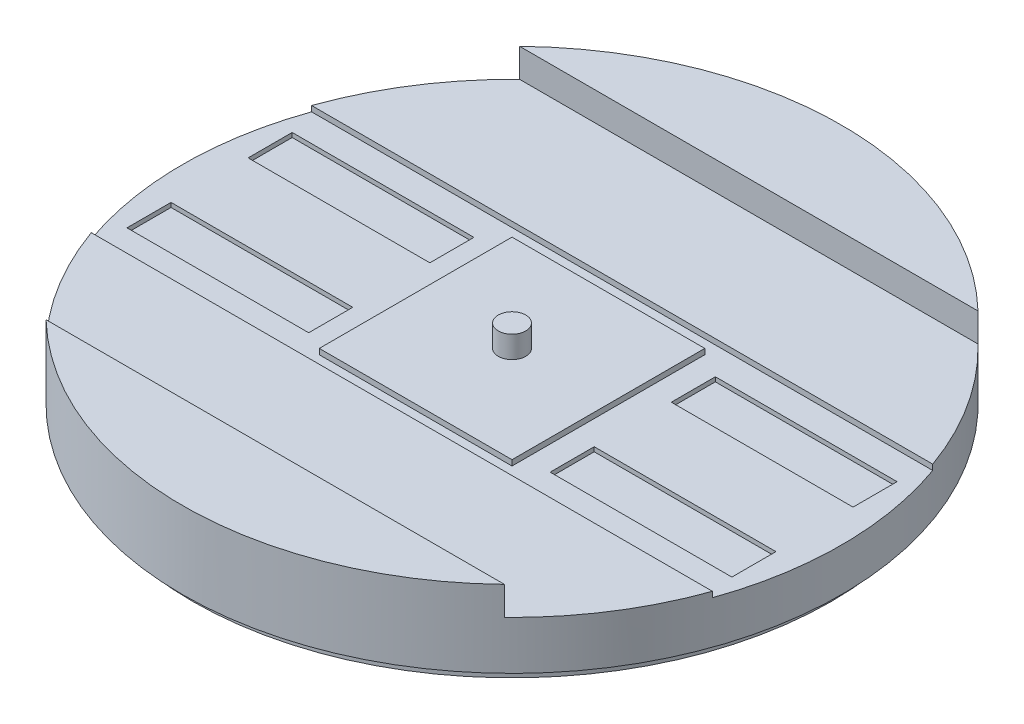
ISO-10303-21;
HEADER;
FILE_DESCRIPTION(('STEP AP214'),'2;1');
FILE_NAME('part.step','',(''),(''),'','','');
FILE_SCHEMA(('AUTOMOTIVE_DESIGN { 1 0 10303 214 1 1 1 1 }'));
ENDSEC;
DATA;
#1=APPLICATION_CONTEXT('core data for automotive mechanical design processes');
#2=APPLICATION_PROTOCOL_DEFINITION('international standard','automotive_design',2000,#1);
#3=PRODUCT_CONTEXT('',#1,'mechanical');
#4=PRODUCT('Part','Part','',(#3));
#5=PRODUCT_RELATED_PRODUCT_CATEGORY('part','',(#4));
#6=PRODUCT_DEFINITION_FORMATION('','',#4);
#7=PRODUCT_DEFINITION_CONTEXT('part definition',#1,'design');
#8=PRODUCT_DEFINITION('design','',#6,#7);
#9=PRODUCT_DEFINITION_SHAPE('','',#8);
#10=(LENGTH_UNIT() NAMED_UNIT(*) SI_UNIT(.MILLI.,.METRE.));
#11=(NAMED_UNIT(*) PLANE_ANGLE_UNIT() SI_UNIT($,.RADIAN.));
#12=(NAMED_UNIT(*) SI_UNIT($,.STERADIAN.) SOLID_ANGLE_UNIT());
#13=UNCERTAINTY_MEASURE_WITH_UNIT(LENGTH_MEASURE(1.E-05),#10,'distance_accuracy_value','');
#14=(GEOMETRIC_REPRESENTATION_CONTEXT(3) GLOBAL_UNCERTAINTY_ASSIGNED_CONTEXT((#13)) GLOBAL_UNIT_ASSIGNED_CONTEXT((#10,
#11,#12)) REPRESENTATION_CONTEXT('',''));
#15=CARTESIAN_POINT('',(0.,0.,0.));
#16=DIRECTION('',(0.,0.,1.));
#17=DIRECTION('',(1.,0.,0.));
#18=AXIS2_PLACEMENT_3D('',#15,#16,#17);
#19=CARTESIAN_POINT('',(-76.,9.906,0.));
#20=DIRECTION('',(0.,1.,0.));
#21=DIRECTION('',(0.,0.,1.));
#22=AXIS2_PLACEMENT_3D('',#19,#20,#21);
#23=PLANE('',#22);
#24=DIRECTION('',(0.,0.,-1.));
#25=VECTOR('',#24,1.);
#26=CARTESIAN_POINT('',(69.7538589904047,9.906,-19.05));
#27=LINE('',#26,#25);
#28=CARTESIAN_POINT('',(69.7538589904047,9.906,-8.88999999999998));
#29=VERTEX_POINT('',#28);
#30=CARTESIAN_POINT('',(69.7538589904047,9.906,-19.05));
#31=VERTEX_POINT('',#30);
#32=EDGE_CURVE('E71',#29,#31,#27,.T.);
#33=ORIENTED_EDGE('',*,*,#32,.F.);
#34=DIRECTION('',(1.,0.,0.));
#35=VECTOR('',#34,1.);
#36=CARTESIAN_POINT('',(69.7538589904047,9.906,-8.88999999999998));
#37=LINE('',#36,#35);
#38=CARTESIAN_POINT('',(27.8438589904047,9.906,-8.89000000000001));
#39=VERTEX_POINT('',#38);
#40=EDGE_CURVE('E368',#39,#29,#37,.T.);
#41=ORIENTED_EDGE('',*,*,#40,.F.);
#42=DIRECTION('',(0.,0.,1.));
#43=VECTOR('',#42,1.);
#44=CARTESIAN_POINT('',(27.8438589904047,9.906,-19.05));
#45=LINE('',#44,#43);
#46=CARTESIAN_POINT('',(27.8438589904047,9.906,-19.05));
#47=VERTEX_POINT('',#46);
#48=EDGE_CURVE('E372',#47,#39,#45,.T.);
#49=ORIENTED_EDGE('',*,*,#48,.F.);
#50=DIRECTION('',(-1.,0.,0.));
#51=VECTOR('',#50,1.);
#52=CARTESIAN_POINT('',(69.7538589904047,9.906,-19.05));
#53=LINE('',#52,#51);
#54=EDGE_CURVE('E377',#31,#47,#53,.T.);
#55=ORIENTED_EDGE('',*,*,#54,.F.);
#56=EDGE_LOOP('',(#33,#41,#49,#55));
#57=FACE_BOUND('',#56,.T.);
#58=DIRECTION('',(1.,0.,0.));
#59=VECTOR('',#58,1.);
#60=CARTESIAN_POINT('',(69.7538589904047,9.906,19.05));
#61=LINE('',#60,#59);
#62=CARTESIAN_POINT('',(27.8438589904047,9.906,19.05));
#63=VERTEX_POINT('',#62);
#64=CARTESIAN_POINT('',(69.7538589904047,9.906,19.05));
#65=VERTEX_POINT('',#64);
#66=EDGE_CURVE('E284',#63,#65,#61,.T.);
#67=ORIENTED_EDGE('',*,*,#66,.F.);
#68=DIRECTION('',(0.,0.,1.));
#69=VECTOR('',#68,1.);
#70=CARTESIAN_POINT('',(27.8438589904047,9.906,19.05));
#71=LINE('',#70,#69);
#72=CARTESIAN_POINT('',(27.8438589904047,9.906,8.89));
#73=VERTEX_POINT('',#72);
#74=EDGE_CURVE('E330',#73,#63,#71,.T.);
#75=ORIENTED_EDGE('',*,*,#74,.F.);
#76=DIRECTION('',(-1.,0.,0.));
#77=VECTOR('',#76,1.);
#78=CARTESIAN_POINT('',(69.7538589904047,9.906,8.89000000000001));
#79=LINE('',#78,#77);
#80=CARTESIAN_POINT('',(69.7538589904047,9.906,8.89000000000001));
#81=VERTEX_POINT('',#80);
#82=EDGE_CURVE('E334',#81,#73,#79,.T.);
#83=ORIENTED_EDGE('',*,*,#82,.F.);
#84=DIRECTION('',(0.,0.,-1.));
#85=VECTOR('',#84,1.);
#86=CARTESIAN_POINT('',(69.7538589904047,9.906,19.05));
#87=LINE('',#86,#85);
#88=EDGE_CURVE('E339',#65,#81,#87,.T.);
#89=ORIENTED_EDGE('',*,*,#88,.F.);
#90=EDGE_LOOP('',(#67,#75,#83,#89));
#91=FACE_BOUND('',#90,.T.);
#92=DIRECTION('',(0.,0.,1.));
#93=VECTOR('',#92,1.);
#94=CARTESIAN_POINT('',(-69.7538589904047,9.906,19.05));
#95=LINE('',#94,#93);
#96=CARTESIAN_POINT('',(-69.7538589904047,9.906,8.88999999999999));
#97=VERTEX_POINT('',#96);
#98=CARTESIAN_POINT('',(-69.7538589904047,9.906,19.05));
#99=VERTEX_POINT('',#98);
#100=EDGE_CURVE('E298',#97,#99,#95,.T.);
#101=ORIENTED_EDGE('',*,*,#100,.F.);
#102=DIRECTION('',(-1.,0.,0.));
#103=VECTOR('',#102,1.);
#104=CARTESIAN_POINT('',(-69.7538589904047,9.906,8.88999999999999));
#105=LINE('',#104,#103);
#106=CARTESIAN_POINT('',(-27.8438589904047,9.906,8.89));
#107=VERTEX_POINT('',#106);
#108=EDGE_CURVE('E285',#107,#97,#105,.T.);
#109=ORIENTED_EDGE('',*,*,#108,.F.);
#110=DIRECTION('',(0.,0.,-1.));
#111=VECTOR('',#110,1.);
#112=CARTESIAN_POINT('',(-27.8438589904047,9.906,19.05));
#113=LINE('',#112,#111);
#114=CARTESIAN_POINT('',(-27.8438589904047,9.906,19.05));
#115=VERTEX_POINT('',#114);
#116=EDGE_CURVE('E289',#115,#107,#113,.T.);
#117=ORIENTED_EDGE('',*,*,#116,.F.);
#118=DIRECTION('',(1.,0.,0.));
#119=VECTOR('',#118,1.);
#120=CARTESIAN_POINT('',(-69.7538589904047,9.906,19.05));
#121=LINE('',#120,#119);
#122=EDGE_CURVE('E294',#99,#115,#121,.T.);
#123=ORIENTED_EDGE('',*,*,#122,.F.);
#124=EDGE_LOOP('',(#101,#109,#117,#123));
#125=FACE_BOUND('',#124,.T.);
#126=DIRECTION('',(0.,0.,1.));
#127=VECTOR('',#126,1.);
#128=CARTESIAN_POINT('',(-69.7538589904047,9.906,-19.05));
#129=LINE('',#128,#127);
#130=CARTESIAN_POINT('',(-69.7538589904047,9.906,-19.05));
#131=VERTEX_POINT('',#130);
#132=CARTESIAN_POINT('',(-69.7538589904047,9.906,-8.89));
#133=VERTEX_POINT('',#132);
#134=EDGE_CURVE('E301',#131,#133,#129,.T.);
#135=ORIENTED_EDGE('',*,*,#134,.F.);
#136=DIRECTION('',(-1.,0.,0.));
#137=VECTOR('',#136,1.);
#138=CARTESIAN_POINT('',(-69.7538589904047,9.906,-19.05));
#139=LINE('',#138,#137);
#140=CARTESIAN_POINT('',(-27.8438589904047,9.906,-19.05));
#141=VERTEX_POINT('',#140);
#142=EDGE_CURVE('E402',#141,#131,#139,.T.);
#143=ORIENTED_EDGE('',*,*,#142,.F.);
#144=DIRECTION('',(0.,0.,-1.));
#145=VECTOR('',#144,1.);
#146=CARTESIAN_POINT('',(-27.8438589904047,9.906,-19.05));
#147=LINE('',#146,#145);
#148=CARTESIAN_POINT('',(-27.8438589904047,9.906,-8.89));
#149=VERTEX_POINT('',#148);
#150=EDGE_CURVE('E421',#149,#141,#147,.T.);
#151=ORIENTED_EDGE('',*,*,#150,.F.);
#152=DIRECTION('',(1.,0.,0.));
#153=VECTOR('',#152,1.);
#154=CARTESIAN_POINT('',(-69.7538589904047,9.906,-8.89));
#155=LINE('',#154,#153);
#156=EDGE_CURVE('E417',#133,#149,#155,.T.);
#157=ORIENTED_EDGE('',*,*,#156,.F.);
#158=EDGE_LOOP('',(#135,#143,#151,#157));
#159=FACE_BOUND('',#158,.T.);
#160=CARTESIAN_POINT('',(0.,9.906,0.));
#161=DIRECTION('',(0.,1.,0.));
#162=DIRECTION('',(0.,0.,1.));
#163=AXIS2_PLACEMENT_3D('',#160,#161,#162);
#164=CIRCLE('',#163,76.);
#165=CARTESIAN_POINT('',(71.6298820325707,9.906,25.4));
#166=VERTEX_POINT('',#165);
#167=CARTESIAN_POINT('',(71.6298820325707,9.906,-25.4));
#168=VERTEX_POINT('',#167);
#169=EDGE_CURVE('E55',#166,#168,#164,.T.);
#170=ORIENTED_EDGE('',*,*,#169,.T.);
#171=DIRECTION('',(-1.,0.,0.));
#172=VECTOR('',#171,1.);
#173=CARTESIAN_POINT('',(25.4,9.906,-25.4));
#174=LINE('',#173,#172);
#175=CARTESIAN_POINT('',(-71.6298820325707,9.906,-25.4));
#176=VERTEX_POINT('',#175);
#177=EDGE_CURVE('E444',#168,#176,#174,.T.);
#178=ORIENTED_EDGE('',*,*,#177,.T.);
#179=CARTESIAN_POINT('',(-71.6298820325707,9.906,25.4));
#180=VERTEX_POINT('',#179);
#181=EDGE_CURVE('E49',#176,#180,#164,.T.);
#182=ORIENTED_EDGE('',*,*,#181,.T.);
#183=DIRECTION('',(1.,0.,0.));
#184=VECTOR('',#183,1.);
#185=CARTESIAN_POINT('',(-76.,9.906,25.4));
#186=LINE('',#185,#184);
#187=EDGE_CURVE('E431',#180,#166,#186,.T.);
#188=ORIENTED_EDGE('',*,*,#187,.T.);
#189=EDGE_LOOP('',(#170,#178,#182,#188));
#190=FACE_BOUND('',#189,.T.);
#191=DIRECTION('',(-1.,0.,0.));
#192=VECTOR('',#191,1.);
#193=CARTESIAN_POINT('',(-22.225,9.906,-22.225));
#194=LINE('',#193,#192);
#195=CARTESIAN_POINT('',(22.225,9.906,-22.225));
#196=VERTEX_POINT('',#195);
#197=CARTESIAN_POINT('',(-22.225,9.906,-22.225));
#198=VERTEX_POINT('',#197);
#199=EDGE_CURVE('E959',#196,#198,#194,.T.);
#200=ORIENTED_EDGE('',*,*,#199,.F.);
#201=DIRECTION('',(0.,0.,-1.));
#202=VECTOR('',#201,1.);
#203=CARTESIAN_POINT('',(22.225,9.906,-22.225));
#204=LINE('',#203,#202);
#205=CARTESIAN_POINT('',(22.225,9.906,22.225));
#206=VERTEX_POINT('',#205);
#207=EDGE_CURVE('E258',#206,#196,#204,.T.);
#208=ORIENTED_EDGE('',*,*,#207,.F.);
#209=DIRECTION('',(1.,0.,0.));
#210=VECTOR('',#209,1.);
#211=CARTESIAN_POINT('',(-22.225,9.906,22.225));
#212=LINE('',#211,#210);
#213=CARTESIAN_POINT('',(-22.225,9.906,22.225));
#214=VERTEX_POINT('',#213);
#215=EDGE_CURVE('E254',#214,#206,#212,.T.);
#216=ORIENTED_EDGE('',*,*,#215,.F.);
#217=DIRECTION('',(0.,0.,1.));
#218=VECTOR('',#217,1.);
#219=CARTESIAN_POINT('',(-22.225,9.906,-22.225));
#220=LINE('',#219,#218);
#221=EDGE_CURVE('E962',#198,#214,#220,.T.);
#222=ORIENTED_EDGE('',*,*,#221,.F.);
#223=EDGE_LOOP('',(#200,#208,#216,#222));
#224=FACE_BOUND('',#223,.T.);
#225=ADVANCED_FACE('F45',(#57,#91,#125,#159,#190,#224),#23,.T.);
#226=CARTESIAN_POINT('',(-76.,11.176,0.));
#227=DIRECTION('',(0.,1.,0.));
#228=DIRECTION('',(0.,0.,1.));
#229=AXIS2_PLACEMENT_3D('',#226,#227,#228);
#230=PLANE('',#229);
#231=DIRECTION('',(-1.,0.,0.));
#232=VECTOR('',#231,1.);
#233=CARTESIAN_POINT('',(-76.,11.176,-25.4));
#234=LINE('',#233,#232);
#235=CARTESIAN_POINT('',(71.6298820325707,11.176,-25.4));
#236=VERTEX_POINT('',#235);
#237=CARTESIAN_POINT('',(-71.6298820325707,11.176,-25.4));
#238=VERTEX_POINT('',#237);
#239=EDGE_CURVE('E512',#236,#238,#234,.T.);
#240=ORIENTED_EDGE('',*,*,#239,.F.);
#241=CARTESIAN_POINT('',(0.,11.176,0.));
#242=DIRECTION('',(0.,1.,0.));
#243=DIRECTION('',(0.,0.,1.));
#244=AXIS2_PLACEMENT_3D('',#241,#242,#243);
#245=CIRCLE('',#244,76.);
#246=CARTESIAN_POINT('',(52.8559164143428,11.176,-54.61));
#247=VERTEX_POINT('',#246);
#248=EDGE_CURVE('E508',#236,#247,#245,.T.);
#249=ORIENTED_EDGE('',*,*,#248,.T.);
#250=DIRECTION('',(-1.,0.,0.));
#251=VECTOR('',#250,1.);
#252=CARTESIAN_POINT('',(-76.,11.176,-54.61));
#253=LINE('',#252,#251);
#254=CARTESIAN_POINT('',(-52.8559164143429,11.176,-54.61));
#255=VERTEX_POINT('',#254);
#256=EDGE_CURVE('E468',#247,#255,#253,.T.);
#257=ORIENTED_EDGE('',*,*,#256,.T.);
#258=EDGE_CURVE('E504',#255,#238,#245,.T.);
#259=ORIENTED_EDGE('',*,*,#258,.T.);
#260=EDGE_LOOP('',(#240,#249,#257,#259));
#261=FACE_BOUND('',#260,.T.);
#262=ADVANCED_FACE('F559',(#261),#230,.T.);
#263=CARTESIAN_POINT('',(0.,17.78,0.));
#264=DIRECTION('',(0.,1.,0.));
#265=DIRECTION('',(0.,0.,1.));
#266=AXIS2_PLACEMENT_3D('',#263,#264,#265);
#267=PLANE('',#266);
#268=DIRECTION('',(-1.,0.,0.));
#269=VECTOR('',#268,1.);
#270=CARTESIAN_POINT('',(0.,17.78,-54.61));
#271=LINE('',#270,#269);
#272=CARTESIAN_POINT('',(52.8559164143429,17.78,-54.61));
#273=VERTEX_POINT('',#272);
#274=CARTESIAN_POINT('',(-52.8559164143429,17.78,-54.61));
#275=VERTEX_POINT('',#274);
#276=EDGE_CURVE('E500',#273,#275,#271,.T.);
#277=ORIENTED_EDGE('',*,*,#276,.F.);
#278=CARTESIAN_POINT('',(0.,17.78,0.));
#279=DIRECTION('',(0.,1.,0.));
#280=DIRECTION('',(0.,0.,1.));
#281=AXIS2_PLACEMENT_3D('',#278,#279,#280);
#282=CIRCLE('',#281,76.);
#283=EDGE_CURVE('E493',#273,#275,#282,.T.);
#284=ORIENTED_EDGE('',*,*,#283,.T.);
#285=EDGE_LOOP('',(#277,#284));
#286=FACE_BOUND('',#285,.T.);
#287=ADVANCED_FACE('F550',(#286),#267,.T.);
#288=CARTESIAN_POINT('',(0.,17.78,0.));
#289=DIRECTION('',(0.,-1.,0.));
#290=DIRECTION('',(0.,0.,-1.));
#291=AXIS2_PLACEMENT_3D('',#288,#289,#290);
#292=CYLINDRICAL_SURFACE('',#291,76.);
#293=ORIENTED_EDGE('',*,*,#248,.F.);
#294=DIRECTION('',(0.,-1.,0.));
#295=VECTOR('',#294,1.);
#296=CARTESIAN_POINT('',(71.6298820325707,17.78,-25.4));
#297=LINE('',#296,#295);
#298=EDGE_CURVE('E460',#236,#168,#297,.T.);
#299=ORIENTED_EDGE('',*,*,#298,.T.);
#300=ORIENTED_EDGE('',*,*,#169,.F.);
#301=DIRECTION('',(0.,-1.,0.));
#302=VECTOR('',#301,1.);
#303=CARTESIAN_POINT('',(71.6298820325707,17.78,25.4));
#304=LINE('',#303,#302);
#305=CARTESIAN_POINT('',(71.6298820325707,11.176,25.4));
#306=VERTEX_POINT('',#305);
#307=EDGE_CURVE('E448',#166,#306,#304,.F.);
#308=ORIENTED_EDGE('',*,*,#307,.T.);
#309=CARTESIAN_POINT('',(52.8559164143429,11.176,54.61));
#310=VERTEX_POINT('',#309);
#311=EDGE_CURVE('E509',#310,#306,#245,.T.);
#312=ORIENTED_EDGE('',*,*,#311,.F.);
#313=DIRECTION('',(0.,-1.,0.));
#314=VECTOR('',#313,1.);
#315=CARTESIAN_POINT('',(52.8559164143429,17.78,54.61));
#316=LINE('',#315,#314);
#317=CARTESIAN_POINT('',(52.8559164143429,17.78,54.61));
#318=VERTEX_POINT('',#317);
#319=EDGE_CURVE('E472',#310,#318,#316,.F.);
#320=ORIENTED_EDGE('',*,*,#319,.T.);
#321=CARTESIAN_POINT('',(-52.8559164143429,17.78,54.61));
#322=VERTEX_POINT('',#321);
#323=EDGE_CURVE('E489',#322,#318,#282,.T.);
#324=ORIENTED_EDGE('',*,*,#323,.F.);
#325=DIRECTION('',(0.,-1.,0.));
#326=VECTOR('',#325,1.);
#327=CARTESIAN_POINT('',(-52.8559164143429,17.78,54.61));
#328=LINE('',#327,#326);
#329=CARTESIAN_POINT('',(-52.8559164143429,11.176,54.61));
#330=VERTEX_POINT('',#329);
#331=EDGE_CURVE('E476',#322,#330,#328,.T.);
#332=ORIENTED_EDGE('',*,*,#331,.T.);
#333=CARTESIAN_POINT('',(-71.6298820325707,11.176,25.4));
#334=VERTEX_POINT('',#333);
#335=EDGE_CURVE('E503',#334,#330,#245,.T.);
#336=ORIENTED_EDGE('',*,*,#335,.F.);
#337=DIRECTION('',(0.,-1.,0.));
#338=VECTOR('',#337,1.);
#339=CARTESIAN_POINT('',(-71.6298820325707,17.78,25.4));
#340=LINE('',#339,#338);
#341=EDGE_CURVE('E452',#334,#180,#340,.T.);
#342=ORIENTED_EDGE('',*,*,#341,.T.);
#343=ORIENTED_EDGE('',*,*,#181,.F.);
#344=DIRECTION('',(0.,-1.,0.));
#345=VECTOR('',#344,1.);
#346=CARTESIAN_POINT('',(-71.6298820325707,17.78,-25.4));
#347=LINE('',#346,#345);
#348=EDGE_CURVE('E456',#176,#238,#347,.F.);
#349=ORIENTED_EDGE('',*,*,#348,.T.);
#350=ORIENTED_EDGE('',*,*,#258,.F.);
#351=DIRECTION('',(0.,-1.,0.));
#352=VECTOR('',#351,1.);
#353=CARTESIAN_POINT('',(-52.8559164143429,17.78,-54.61));
#354=LINE('',#353,#352);
#355=EDGE_CURVE('E480',#255,#275,#354,.F.);
#356=ORIENTED_EDGE('',*,*,#355,.T.);
#357=ORIENTED_EDGE('',*,*,#283,.F.);
#358=DIRECTION('',(0.,-1.,0.));
#359=VECTOR('',#358,1.);
#360=CARTESIAN_POINT('',(52.8559164143429,17.78,-54.61));
#361=LINE('',#360,#359);
#362=EDGE_CURVE('E484',#273,#247,#361,.T.);
#363=ORIENTED_EDGE('',*,*,#362,.T.);
#364=EDGE_LOOP('',(#293,#299,#300,#308,#312,#320,#324,#332,#336,#342,#343,#349,#350,#356,#357,#363));
#365=FACE_BOUND('',#364,.T.);
#366=CARTESIAN_POINT('',(0.,0.,0.));
#367=DIRECTION('',(0.,1.,0.));
#368=DIRECTION('',(0.,0.,1.));
#369=AXIS2_PLACEMENT_3D('',#366,#367,#368);
#370=CIRCLE('',#369,76.);
#371=CARTESIAN_POINT('',(0.,0.,76.));
#372=VERTEX_POINT('',#371);
#373=EDGE_CURVE('E488',#372,#372,#370,.T.);
#374=ORIENTED_EDGE('',*,*,#373,.T.);
#375=EDGE_LOOP('',(#374));
#376=FACE_BOUND('',#375,.T.);
#377=ADVANCED_FACE('F47',(#365,#376),#292,.T.);
#378=DIRECTION('',(1.,0.,0.));
#379=VECTOR('',#378,1.);
#380=CARTESIAN_POINT('',(0.,17.78,54.61));
#381=LINE('',#380,#379);
#382=EDGE_CURVE('E497',#322,#318,#381,.T.);
#383=ORIENTED_EDGE('',*,*,#382,.F.);
#384=ORIENTED_EDGE('',*,*,#323,.T.);
#385=EDGE_LOOP('',(#383,#384));
#386=FACE_BOUND('',#385,.T.);
#387=ADVANCED_FACE('F546',(#386),#267,.T.);
#388=CARTESIAN_POINT('',(0.,0.,0.));
#389=DIRECTION('',(0.,1.,0.));
#390=DIRECTION('',(0.,0.,1.));
#391=AXIS2_PLACEMENT_3D('',#388,#389,#390);
#392=PLANE('',#391);
#393=CARTESIAN_POINT('',(0.,0.,0.));
#394=DIRECTION('',(0.,-1.,0.));
#395=DIRECTION('',(0.,0.,-1.));
#396=AXIS2_PLACEMENT_3D('',#393,#394,#395);
#397=CIRCLE('',#396,73.66);
#398=CARTESIAN_POINT('',(0.,0.,-73.66));
#399=VERTEX_POINT('',#398);
#400=EDGE_CURVE('E11',#399,#399,#397,.T.);
#401=ORIENTED_EDGE('',*,*,#400,.F.);
#402=EDGE_LOOP('',(#401));
#403=FACE_BOUND('',#402,.T.);
#404=ORIENTED_EDGE('',*,*,#373,.F.);
#405=EDGE_LOOP('',(#404));
#406=FACE_BOUND('',#405,.T.);
#407=ADVANCED_FACE('F548',(#403,#406),#392,.F.);
#408=DIRECTION('',(1.,0.,0.));
#409=VECTOR('',#408,1.);
#410=CARTESIAN_POINT('',(-76.,11.176,25.4));
#411=LINE('',#410,#409);
#412=EDGE_CURVE('E510',#334,#306,#411,.T.);
#413=ORIENTED_EDGE('',*,*,#412,.F.);
#414=ORIENTED_EDGE('',*,*,#335,.T.);
#415=DIRECTION('',(1.,0.,0.));
#416=VECTOR('',#415,1.);
#417=CARTESIAN_POINT('',(-76.,11.176,54.61));
#418=LINE('',#417,#416);
#419=EDGE_CURVE('E464',#330,#310,#418,.T.);
#420=ORIENTED_EDGE('',*,*,#419,.T.);
#421=ORIENTED_EDGE('',*,*,#311,.T.);
#422=EDGE_LOOP('',(#413,#414,#420,#421));
#423=FACE_BOUND('',#422,.T.);
#424=ADVANCED_FACE('F539',(#423),#230,.T.);
#425=CARTESIAN_POINT('',(-76.,11.176,-54.61));
#426=DIRECTION('',(0.,0.,-1.));
#427=DIRECTION('',(-1.,0.,0.));
#428=AXIS2_PLACEMENT_3D('',#425,#426,#427);
#429=PLANE('',#428);
#430=ORIENTED_EDGE('',*,*,#276,.T.);
#431=ORIENTED_EDGE('',*,*,#355,.F.);
#432=ORIENTED_EDGE('',*,*,#256,.F.);
#433=ORIENTED_EDGE('',*,*,#362,.F.);
#434=EDGE_LOOP('',(#430,#431,#432,#433));
#435=FACE_BOUND('',#434,.T.);
#436=ADVANCED_FACE('F582',(#435),#429,.F.);
#437=CARTESIAN_POINT('',(-76.,11.176,54.61));
#438=DIRECTION('',(0.,0.,1.));
#439=DIRECTION('',(1.,0.,0.));
#440=AXIS2_PLACEMENT_3D('',#437,#438,#439);
#441=PLANE('',#440);
#442=ORIENTED_EDGE('',*,*,#382,.T.);
#443=ORIENTED_EDGE('',*,*,#319,.F.);
#444=ORIENTED_EDGE('',*,*,#419,.F.);
#445=ORIENTED_EDGE('',*,*,#331,.F.);
#446=EDGE_LOOP('',(#442,#443,#444,#445));
#447=FACE_BOUND('',#446,.T.);
#448=ADVANCED_FACE('F542',(#447),#441,.F.);
#449=CARTESIAN_POINT('',(-76.,9.906,-25.4));
#450=DIRECTION('',(0.,0.,-1.));
#451=DIRECTION('',(-1.,0.,0.));
#452=AXIS2_PLACEMENT_3D('',#449,#450,#451);
#453=PLANE('',#452);
#454=ORIENTED_EDGE('',*,*,#239,.T.);
#455=ORIENTED_EDGE('',*,*,#348,.F.);
#456=ORIENTED_EDGE('',*,*,#177,.F.);
#457=ORIENTED_EDGE('',*,*,#298,.F.);
#458=EDGE_LOOP('',(#454,#455,#456,#457));
#459=FACE_BOUND('',#458,.T.);
#460=ADVANCED_FACE('F525',(#459),#453,.F.);
#461=CARTESIAN_POINT('',(25.4,9.906,25.4));
#462=DIRECTION('',(0.,0.,1.));
#463=DIRECTION('',(1.,0.,0.));
#464=AXIS2_PLACEMENT_3D('',#461,#462,#463);
#465=PLANE('',#464);
#466=ORIENTED_EDGE('',*,*,#412,.T.);
#467=ORIENTED_EDGE('',*,*,#307,.F.);
#468=ORIENTED_EDGE('',*,*,#187,.F.);
#469=ORIENTED_EDGE('',*,*,#341,.F.);
#470=EDGE_LOOP('',(#466,#467,#468,#469));
#471=FACE_BOUND('',#470,.T.);
#472=ADVANCED_FACE('F577',(#471),#465,.F.);
#473=CARTESIAN_POINT('',(-69.7538589904047,8.89,-19.05));
#474=DIRECTION('',(-1.,0.,0.));
#475=DIRECTION('',(0.,0.,1.));
#476=AXIS2_PLACEMENT_3D('',#473,#474,#475);
#477=PLANE('',#476);
#478=ORIENTED_EDGE('',*,*,#134,.T.);
#479=DIRECTION('',(0.,1.,0.));
#480=VECTOR('',#479,1.);
#481=CARTESIAN_POINT('',(-69.7538589904047,8.89,-8.89));
#482=LINE('',#481,#480);
#483=CARTESIAN_POINT('',(-69.7538589904047,8.89,-8.89));
#484=VERTEX_POINT('',#483);
#485=EDGE_CURVE('E414',#484,#133,#482,.T.);
#486=ORIENTED_EDGE('',*,*,#485,.F.);
#487=DIRECTION('',(0.,0.,1.));
#488=VECTOR('',#487,1.);
#489=CARTESIAN_POINT('',(-69.7538589904047,8.89,-19.05));
#490=LINE('',#489,#488);
#491=CARTESIAN_POINT('',(-69.7538589904047,8.89,-19.05));
#492=VERTEX_POINT('',#491);
#493=EDGE_CURVE('E397',#492,#484,#490,.T.);
#494=ORIENTED_EDGE('',*,*,#493,.F.);
#495=DIRECTION('',(0.,1.,0.));
#496=VECTOR('',#495,1.);
#497=CARTESIAN_POINT('',(-69.7538589904047,8.89,-19.05));
#498=LINE('',#497,#496);
#499=EDGE_CURVE('E428',#492,#131,#498,.T.);
#500=ORIENTED_EDGE('',*,*,#499,.T.);
#501=EDGE_LOOP('',(#478,#486,#494,#500));
#502=FACE_BOUND('',#501,.T.);
#503=ADVANCED_FACE('F573',(#502),#477,.F.);
#504=CARTESIAN_POINT('',(-69.7538589904047,8.89,-19.05));
#505=DIRECTION('',(0.,0.,-1.));
#506=DIRECTION('',(-1.,0.,0.));
#507=AXIS2_PLACEMENT_3D('',#504,#505,#506);
#508=PLANE('',#507);
#509=ORIENTED_EDGE('',*,*,#142,.T.);
#510=ORIENTED_EDGE('',*,*,#499,.F.);
#511=DIRECTION('',(-1.,0.,0.));
#512=VECTOR('',#511,1.);
#513=CARTESIAN_POINT('',(-69.7538589904047,8.89,-19.05));
#514=LINE('',#513,#512);
#515=CARTESIAN_POINT('',(-27.8438589904047,8.89,-19.05));
#516=VERTEX_POINT('',#515);
#517=EDGE_CURVE('E410',#516,#492,#514,.T.);
#518=ORIENTED_EDGE('',*,*,#517,.F.);
#519=DIRECTION('',(0.,1.,0.));
#520=VECTOR('',#519,1.);
#521=CARTESIAN_POINT('',(-27.8438589904047,8.89,-19.05));
#522=LINE('',#521,#520);
#523=EDGE_CURVE('E432',#516,#141,#522,.T.);
#524=ORIENTED_EDGE('',*,*,#523,.T.);
#525=EDGE_LOOP('',(#509,#510,#518,#524));
#526=FACE_BOUND('',#525,.T.);
#527=ADVANCED_FACE('F623',(#526),#508,.F.);
#528=CARTESIAN_POINT('',(-27.8438589904047,8.89,-19.05));
#529=DIRECTION('',(1.,0.,0.));
#530=DIRECTION('',(0.,0.,-1.));
#531=AXIS2_PLACEMENT_3D('',#528,#529,#530);
#532=PLANE('',#531);
#533=ORIENTED_EDGE('',*,*,#150,.T.);
#534=ORIENTED_EDGE('',*,*,#523,.F.);
#535=DIRECTION('',(0.,0.,-1.));
#536=VECTOR('',#535,1.);
#537=CARTESIAN_POINT('',(-27.8438589904047,8.89,-19.05));
#538=LINE('',#537,#536);
#539=CARTESIAN_POINT('',(-27.8438589904047,8.89,-8.89));
#540=VERTEX_POINT('',#539);
#541=EDGE_CURVE('E406',#540,#516,#538,.T.);
#542=ORIENTED_EDGE('',*,*,#541,.F.);
#543=DIRECTION('',(0.,1.,0.));
#544=VECTOR('',#543,1.);
#545=CARTESIAN_POINT('',(-27.8438589904047,8.89,-8.89));
#546=LINE('',#545,#544);
#547=EDGE_CURVE('E435',#540,#149,#546,.T.);
#548=ORIENTED_EDGE('',*,*,#547,.T.);
#549=EDGE_LOOP('',(#533,#534,#542,#548));
#550=FACE_BOUND('',#549,.T.);
#551=ADVANCED_FACE('F631',(#550),#532,.F.);
#552=CARTESIAN_POINT('',(-69.7538589904047,8.89,-8.89));
#553=DIRECTION('',(0.,0.,1.));
#554=DIRECTION('',(1.,0.,0.));
#555=AXIS2_PLACEMENT_3D('',#552,#553,#554);
#556=PLANE('',#555);
#557=ORIENTED_EDGE('',*,*,#156,.T.);
#558=ORIENTED_EDGE('',*,*,#547,.F.);
#559=DIRECTION('',(1.,0.,0.));
#560=VECTOR('',#559,1.);
#561=CARTESIAN_POINT('',(-69.7538589904047,8.89,-8.89));
#562=LINE('',#561,#560);
#563=EDGE_CURVE('E401',#484,#540,#562,.T.);
#564=ORIENTED_EDGE('',*,*,#563,.F.);
#565=ORIENTED_EDGE('',*,*,#485,.T.);
#566=EDGE_LOOP('',(#557,#558,#564,#565));
#567=FACE_BOUND('',#566,.T.);
#568=ADVANCED_FACE('F640',(#567),#556,.F.);
#569=CARTESIAN_POINT('',(0.,8.89,0.));
#570=DIRECTION('',(0.,1.,0.));
#571=DIRECTION('',(0.,0.,1.));
#572=AXIS2_PLACEMENT_3D('',#569,#570,#571);
#573=PLANE('',#572);
#574=ORIENTED_EDGE('',*,*,#493,.T.);
#575=ORIENTED_EDGE('',*,*,#563,.T.);
#576=ORIENTED_EDGE('',*,*,#541,.T.);
#577=ORIENTED_EDGE('',*,*,#517,.T.);
#578=EDGE_LOOP('',(#574,#575,#576,#577));
#579=FACE_BOUND('',#578,.T.);
#580=ADVANCED_FACE('F649',(#579),#573,.T.);
#581=CARTESIAN_POINT('',(-69.7538589904047,8.89,19.05));
#582=DIRECTION('',(-1.,0.,0.));
#583=DIRECTION('',(0.,0.,1.));
#584=AXIS2_PLACEMENT_3D('',#581,#582,#583);
#585=PLANE('',#584);
#586=ORIENTED_EDGE('',*,*,#100,.T.);
#587=DIRECTION('',(0.,1.,0.));
#588=VECTOR('',#587,1.);
#589=CARTESIAN_POINT('',(-69.7538589904047,8.89,19.05));
#590=LINE('',#589,#588);
#591=CARTESIAN_POINT('',(-69.7538589904047,8.89,19.05));
#592=VERTEX_POINT('',#591);
#593=EDGE_CURVE('E270',#592,#99,#590,.T.);
#594=ORIENTED_EDGE('',*,*,#593,.F.);
#595=DIRECTION('',(0.,0.,1.));
#596=VECTOR('',#595,1.);
#597=CARTESIAN_POINT('',(-69.7538589904047,8.89,19.05));
#598=LINE('',#597,#596);
#599=CARTESIAN_POINT('',(-69.7538589904047,8.89,8.88999999999999));
#600=VERTEX_POINT('',#599);
#601=EDGE_CURVE('E290',#600,#592,#598,.T.);
#602=ORIENTED_EDGE('',*,*,#601,.F.);
#603=DIRECTION('',(0.,1.,0.));
#604=VECTOR('',#603,1.);
#605=CARTESIAN_POINT('',(-69.7538589904047,8.89,8.88999999999999));
#606=LINE('',#605,#604);
#607=EDGE_CURVE('E281',#600,#97,#606,.T.);
#608=ORIENTED_EDGE('',*,*,#607,.T.);
#609=EDGE_LOOP('',(#586,#594,#602,#608));
#610=FACE_BOUND('',#609,.T.);
#611=ADVANCED_FACE('F657',(#610),#585,.F.);
#612=CARTESIAN_POINT('',(-69.7538589904047,8.89,8.88999999999999));
#613=DIRECTION('',(0.,0.,-1.));
#614=DIRECTION('',(-1.,0.,0.));
#615=AXIS2_PLACEMENT_3D('',#612,#613,#614);
#616=PLANE('',#615);
#617=ORIENTED_EDGE('',*,*,#108,.T.);
#618=ORIENTED_EDGE('',*,*,#607,.F.);
#619=DIRECTION('',(-1.,0.,0.));
#620=VECTOR('',#619,1.);
#621=CARTESIAN_POINT('',(-69.7538589904047,8.89,8.88999999999999));
#622=LINE('',#621,#620);
#623=CARTESIAN_POINT('',(-27.8438589904047,8.89,8.89));
#624=VERTEX_POINT('',#623);
#625=EDGE_CURVE('E274',#624,#600,#622,.T.);
#626=ORIENTED_EDGE('',*,*,#625,.F.);
#627=DIRECTION('',(0.,1.,0.));
#628=VECTOR('',#627,1.);
#629=CARTESIAN_POINT('',(-27.8438589904047,8.89,8.89));
#630=LINE('',#629,#628);
#631=EDGE_CURVE('E278',#624,#107,#630,.T.);
#632=ORIENTED_EDGE('',*,*,#631,.T.);
#633=EDGE_LOOP('',(#617,#618,#626,#632));
#634=FACE_BOUND('',#633,.T.);
#635=ADVANCED_FACE('F666',(#634),#616,.F.);
#636=CARTESIAN_POINT('',(-27.8438589904047,8.89,19.05));
#637=DIRECTION('',(1.,0.,0.));
#638=DIRECTION('',(0.,0.,-1.));
#639=AXIS2_PLACEMENT_3D('',#636,#637,#638);
#640=PLANE('',#639);
#641=ORIENTED_EDGE('',*,*,#116,.T.);
#642=ORIENTED_EDGE('',*,*,#631,.F.);
#643=DIRECTION('',(0.,0.,-1.));
#644=VECTOR('',#643,1.);
#645=CARTESIAN_POINT('',(-27.8438589904047,8.89,19.05));
#646=LINE('',#645,#644);
#647=CARTESIAN_POINT('',(-27.8438589904047,8.89,19.05));
#648=VERTEX_POINT('',#647);
#649=EDGE_CURVE('E305',#648,#624,#646,.T.);
#650=ORIENTED_EDGE('',*,*,#649,.F.);
#651=DIRECTION('',(0.,1.,0.));
#652=VECTOR('',#651,1.);
#653=CARTESIAN_POINT('',(-27.8438589904047,8.89,19.05));
#654=LINE('',#653,#652);
#655=EDGE_CURVE('E275',#648,#115,#654,.T.);
#656=ORIENTED_EDGE('',*,*,#655,.T.);
#657=EDGE_LOOP('',(#641,#642,#650,#656));
#658=FACE_BOUND('',#657,.T.);
#659=ADVANCED_FACE('F675',(#658),#640,.F.);
#660=CARTESIAN_POINT('',(-69.7538589904047,8.89,19.05));
#661=DIRECTION('',(0.,0.,1.));
#662=DIRECTION('',(1.,0.,0.));
#663=AXIS2_PLACEMENT_3D('',#660,#661,#662);
#664=PLANE('',#663);
#665=ORIENTED_EDGE('',*,*,#122,.T.);
#666=ORIENTED_EDGE('',*,*,#655,.F.);
#667=DIRECTION('',(1.,0.,0.));
#668=VECTOR('',#667,1.);
#669=CARTESIAN_POINT('',(-69.7538589904047,8.89,19.05));
#670=LINE('',#669,#668);
#671=EDGE_CURVE('E309',#592,#648,#670,.T.);
#672=ORIENTED_EDGE('',*,*,#671,.F.);
#673=ORIENTED_EDGE('',*,*,#593,.T.);
#674=EDGE_LOOP('',(#665,#666,#672,#673));
#675=FACE_BOUND('',#674,.T.);
#676=ADVANCED_FACE('F684',(#675),#664,.F.);
#677=CARTESIAN_POINT('',(0.,8.89,0.));
#678=DIRECTION('',(0.,-1.,0.));
#679=DIRECTION('',(0.,0.,-1.));
#680=AXIS2_PLACEMENT_3D('',#677,#678,#679);
#681=PLANE('',#680);
#682=ORIENTED_EDGE('',*,*,#601,.T.);
#683=ORIENTED_EDGE('',*,*,#671,.T.);
#684=ORIENTED_EDGE('',*,*,#649,.T.);
#685=ORIENTED_EDGE('',*,*,#625,.T.);
#686=EDGE_LOOP('',(#682,#683,#684,#685));
#687=FACE_BOUND('',#686,.T.);
#688=ADVANCED_FACE('F693',(#687),#681,.F.);
#689=CARTESIAN_POINT('',(69.7538589904047,8.89,19.05));
#690=DIRECTION('',(0.,0.,1.));
#691=DIRECTION('',(1.,0.,0.));
#692=AXIS2_PLACEMENT_3D('',#689,#690,#691);
#693=PLANE('',#692);
#694=ORIENTED_EDGE('',*,*,#66,.T.);
#695=DIRECTION('',(0.,1.,0.));
#696=VECTOR('',#695,1.);
#697=CARTESIAN_POINT('',(69.7538589904047,8.89,19.05));
#698=LINE('',#697,#696);
#699=CARTESIAN_POINT('',(69.7538589904047,8.89,19.05));
#700=VERTEX_POINT('',#699);
#701=EDGE_CURVE('E316',#700,#65,#698,.T.);
#702=ORIENTED_EDGE('',*,*,#701,.F.);
#703=DIRECTION('',(1.,0.,0.));
#704=VECTOR('',#703,1.);
#705=CARTESIAN_POINT('',(69.7538589904047,8.89,19.05));
#706=LINE('',#705,#704);
#707=CARTESIAN_POINT('',(27.8438589904047,8.89,19.05));
#708=VERTEX_POINT('',#707);
#709=EDGE_CURVE('E335',#708,#700,#706,.T.);
#710=ORIENTED_EDGE('',*,*,#709,.F.);
#711=DIRECTION('',(0.,1.,0.));
#712=VECTOR('',#711,1.);
#713=CARTESIAN_POINT('',(27.8438589904047,8.89,19.05));
#714=LINE('',#713,#712);
#715=EDGE_CURVE('E327',#708,#63,#714,.T.);
#716=ORIENTED_EDGE('',*,*,#715,.T.);
#717=EDGE_LOOP('',(#694,#702,#710,#716));
#718=FACE_BOUND('',#717,.T.);
#719=ADVANCED_FACE('F702',(#718),#693,.F.);
#720=CARTESIAN_POINT('',(27.8438589904047,8.89,19.05));
#721=DIRECTION('',(-1.,0.,0.));
#722=DIRECTION('',(0.,0.,1.));
#723=AXIS2_PLACEMENT_3D('',#720,#721,#722);
#724=PLANE('',#723);
#725=ORIENTED_EDGE('',*,*,#74,.T.);
#726=ORIENTED_EDGE('',*,*,#715,.F.);
#727=DIRECTION('',(0.,0.,1.));
#728=VECTOR('',#727,1.);
#729=CARTESIAN_POINT('',(27.8438589904047,8.89,19.05));
#730=LINE('',#729,#728);
#731=CARTESIAN_POINT('',(27.8438589904047,8.89,8.89));
#732=VERTEX_POINT('',#731);
#733=EDGE_CURVE('E320',#732,#708,#730,.T.);
#734=ORIENTED_EDGE('',*,*,#733,.F.);
#735=DIRECTION('',(0.,1.,0.));
#736=VECTOR('',#735,1.);
#737=CARTESIAN_POINT('',(27.8438589904047,8.89,8.89));
#738=LINE('',#737,#736);
#739=EDGE_CURVE('E324',#732,#73,#738,.T.);
#740=ORIENTED_EDGE('',*,*,#739,.T.);
#741=EDGE_LOOP('',(#725,#726,#734,#740));
#742=FACE_BOUND('',#741,.T.);
#743=ADVANCED_FACE('F711',(#742),#724,.F.);
#744=CARTESIAN_POINT('',(69.7538589904047,8.89,8.89000000000001));
#745=DIRECTION('',(0.,0.,-1.));
#746=DIRECTION('',(-1.,0.,0.));
#747=AXIS2_PLACEMENT_3D('',#744,#745,#746);
#748=PLANE('',#747);
#749=ORIENTED_EDGE('',*,*,#82,.T.);
#750=ORIENTED_EDGE('',*,*,#739,.F.);
#751=DIRECTION('',(-1.,0.,0.));
#752=VECTOR('',#751,1.);
#753=CARTESIAN_POINT('',(69.7538589904047,8.89,8.89000000000001));
#754=LINE('',#753,#752);
#755=CARTESIAN_POINT('',(69.7538589904047,8.89,8.89000000000001));
#756=VERTEX_POINT('',#755);
#757=EDGE_CURVE('E348',#756,#732,#754,.T.);
#758=ORIENTED_EDGE('',*,*,#757,.F.);
#759=DIRECTION('',(0.,1.,0.));
#760=VECTOR('',#759,1.);
#761=CARTESIAN_POINT('',(69.7538589904047,8.89,8.89000000000001));
#762=LINE('',#761,#760);
#763=EDGE_CURVE('E321',#756,#81,#762,.T.);
#764=ORIENTED_EDGE('',*,*,#763,.T.);
#765=EDGE_LOOP('',(#749,#750,#758,#764));
#766=FACE_BOUND('',#765,.T.);
#767=ADVANCED_FACE('F720',(#766),#748,.F.);
#768=CARTESIAN_POINT('',(69.7538589904047,8.89,19.05));
#769=DIRECTION('',(1.,0.,0.));
#770=DIRECTION('',(0.,0.,-1.));
#771=AXIS2_PLACEMENT_3D('',#768,#769,#770);
#772=PLANE('',#771);
#773=ORIENTED_EDGE('',*,*,#88,.T.);
#774=ORIENTED_EDGE('',*,*,#763,.F.);
#775=DIRECTION('',(0.,0.,-1.));
#776=VECTOR('',#775,1.);
#777=CARTESIAN_POINT('',(69.7538589904047,8.89,19.05));
#778=LINE('',#777,#776);
#779=EDGE_CURVE('E352',#700,#756,#778,.T.);
#780=ORIENTED_EDGE('',*,*,#779,.F.);
#781=ORIENTED_EDGE('',*,*,#701,.T.);
#782=EDGE_LOOP('',(#773,#774,#780,#781));
#783=FACE_BOUND('',#782,.T.);
#784=ADVANCED_FACE('F729',(#783),#772,.F.);
#785=CARTESIAN_POINT('',(0.,8.89,0.));
#786=DIRECTION('',(0.,-1.,0.));
#787=DIRECTION('',(0.,0.,-1.));
#788=AXIS2_PLACEMENT_3D('',#785,#786,#787);
#789=PLANE('',#788);
#790=ORIENTED_EDGE('',*,*,#709,.T.);
#791=ORIENTED_EDGE('',*,*,#779,.T.);
#792=ORIENTED_EDGE('',*,*,#757,.T.);
#793=ORIENTED_EDGE('',*,*,#733,.T.);
#794=EDGE_LOOP('',(#790,#791,#792,#793));
#795=FACE_BOUND('',#794,.T.);
#796=ADVANCED_FACE('F738',(#795),#789,.F.);
#797=CARTESIAN_POINT('',(69.7538589904047,8.89,-19.05));
#798=DIRECTION('',(1.,0.,0.));
#799=DIRECTION('',(0.,0.,-1.));
#800=AXIS2_PLACEMENT_3D('',#797,#798,#799);
#801=PLANE('',#800);
#802=ORIENTED_EDGE('',*,*,#32,.T.);
#803=DIRECTION('',(0.,1.,0.));
#804=VECTOR('',#803,1.);
#805=CARTESIAN_POINT('',(69.7538589904047,8.89,-19.05));
#806=LINE('',#805,#804);
#807=CARTESIAN_POINT('',(69.7538589904047,8.89,-19.05));
#808=VERTEX_POINT('',#807);
#809=EDGE_CURVE('E359',#808,#31,#806,.T.);
#810=ORIENTED_EDGE('',*,*,#809,.F.);
#811=DIRECTION('',(0.,0.,-1.));
#812=VECTOR('',#811,1.);
#813=CARTESIAN_POINT('',(69.7538589904047,8.89,-19.05));
#814=LINE('',#813,#812);
#815=CARTESIAN_POINT('',(69.7538589904047,8.89,-8.88999999999998));
#816=VERTEX_POINT('',#815);
#817=EDGE_CURVE('E373',#816,#808,#814,.T.);
#818=ORIENTED_EDGE('',*,*,#817,.F.);
#819=DIRECTION('',(0.,1.,0.));
#820=VECTOR('',#819,1.);
#821=CARTESIAN_POINT('',(69.7538589904047,8.89,-8.88999999999998));
#822=LINE('',#821,#820);
#823=EDGE_CURVE('E261',#816,#29,#822,.T.);
#824=ORIENTED_EDGE('',*,*,#823,.T.);
#825=EDGE_LOOP('',(#802,#810,#818,#824));
#826=FACE_BOUND('',#825,.T.);
#827=ADVANCED_FACE('F747',(#826),#801,.F.);
#828=CARTESIAN_POINT('',(69.7538589904047,8.89,-8.88999999999998));
#829=DIRECTION('',(0.,0.,1.));
#830=DIRECTION('',(1.,0.,0.));
#831=AXIS2_PLACEMENT_3D('',#828,#829,#830);
#832=PLANE('',#831);
#833=ORIENTED_EDGE('',*,*,#40,.T.);
#834=ORIENTED_EDGE('',*,*,#823,.F.);
#835=DIRECTION('',(1.,0.,0.));
#836=VECTOR('',#835,1.);
#837=CARTESIAN_POINT('',(69.7538589904047,8.89,-8.88999999999998));
#838=LINE('',#837,#836);
#839=CARTESIAN_POINT('',(27.8438589904047,8.89,-8.89000000000001));
#840=VERTEX_POINT('',#839);
#841=EDGE_CURVE('E362',#840,#816,#838,.T.);
#842=ORIENTED_EDGE('',*,*,#841,.F.);
#843=DIRECTION('',(0.,1.,0.));
#844=VECTOR('',#843,1.);
#845=CARTESIAN_POINT('',(27.8438589904047,8.89,-8.89000000000001));
#846=LINE('',#845,#844);
#847=EDGE_CURVE('E265',#840,#39,#846,.T.);
#848=ORIENTED_EDGE('',*,*,#847,.T.);
#849=EDGE_LOOP('',(#833,#834,#842,#848));
#850=FACE_BOUND('',#849,.T.);
#851=ADVANCED_FACE('F756',(#850),#832,.F.);
#852=CARTESIAN_POINT('',(27.8438589904047,8.89,-19.05));
#853=DIRECTION('',(-1.,0.,0.));
#854=DIRECTION('',(0.,0.,1.));
#855=AXIS2_PLACEMENT_3D('',#852,#853,#854);
#856=PLANE('',#855);
#857=ORIENTED_EDGE('',*,*,#48,.T.);
#858=ORIENTED_EDGE('',*,*,#847,.F.);
#859=DIRECTION('',(0.,0.,1.));
#860=VECTOR('',#859,1.);
#861=CARTESIAN_POINT('',(27.8438589904047,8.89,-19.05));
#862=LINE('',#861,#860);
#863=CARTESIAN_POINT('',(27.8438589904047,8.89,-19.05));
#864=VERTEX_POINT('',#863);
#865=EDGE_CURVE('E386',#864,#840,#862,.T.);
#866=ORIENTED_EDGE('',*,*,#865,.F.);
#867=DIRECTION('',(0.,1.,0.));
#868=VECTOR('',#867,1.);
#869=CARTESIAN_POINT('',(27.8438589904047,8.89,-19.05));
#870=LINE('',#869,#868);
#871=EDGE_CURVE('E363',#864,#47,#870,.T.);
#872=ORIENTED_EDGE('',*,*,#871,.T.);
#873=EDGE_LOOP('',(#857,#858,#866,#872));
#874=FACE_BOUND('',#873,.T.);
#875=ADVANCED_FACE('F764',(#874),#856,.F.);
#876=CARTESIAN_POINT('',(69.7538589904047,8.89,-19.05));
#877=DIRECTION('',(0.,0.,-1.));
#878=DIRECTION('',(-1.,0.,0.));
#879=AXIS2_PLACEMENT_3D('',#876,#877,#878);
#880=PLANE('',#879);
#881=ORIENTED_EDGE('',*,*,#54,.T.);
#882=ORIENTED_EDGE('',*,*,#871,.F.);
#883=DIRECTION('',(-1.,0.,0.));
#884=VECTOR('',#883,1.);
#885=CARTESIAN_POINT('',(69.7538589904047,8.89,-19.05));
#886=LINE('',#885,#884);
#887=EDGE_CURVE('E390',#808,#864,#886,.T.);
#888=ORIENTED_EDGE('',*,*,#887,.F.);
#889=ORIENTED_EDGE('',*,*,#809,.T.);
#890=EDGE_LOOP('',(#881,#882,#888,#889));
#891=FACE_BOUND('',#890,.T.);
#892=ADVANCED_FACE('F773',(#891),#880,.F.);
#893=CARTESIAN_POINT('',(0.,8.89,0.));
#894=DIRECTION('',(0.,-1.,0.));
#895=DIRECTION('',(0.,0.,-1.));
#896=AXIS2_PLACEMENT_3D('',#893,#894,#895);
#897=PLANE('',#896);
#898=ORIENTED_EDGE('',*,*,#817,.T.);
#899=ORIENTED_EDGE('',*,*,#887,.T.);
#900=ORIENTED_EDGE('',*,*,#865,.T.);
#901=ORIENTED_EDGE('',*,*,#841,.T.);
#902=EDGE_LOOP('',(#898,#899,#900,#901));
#903=FACE_BOUND('',#902,.T.);
#904=ADVANCED_FACE('F781',(#903),#897,.F.);
#905=CARTESIAN_POINT('',(22.225,11.176,-22.225));
#906=DIRECTION('',(-1.,0.,0.));
#907=DIRECTION('',(0.,0.,1.));
#908=AXIS2_PLACEMENT_3D('',#905,#906,#907);
#909=PLANE('',#908);
#910=ORIENTED_EDGE('',*,*,#207,.T.);
#911=DIRECTION('',(0.,-1.,0.));
#912=VECTOR('',#911,1.);
#913=CARTESIAN_POINT('',(22.225,11.176,-22.225));
#914=LINE('',#913,#912);
#915=CARTESIAN_POINT('',(22.225,11.176,-22.225));
#916=VERTEX_POINT('',#915);
#917=EDGE_CURVE('E237',#916,#196,#914,.T.);
#918=ORIENTED_EDGE('',*,*,#917,.F.);
#919=DIRECTION('',(0.,0.,-1.));
#920=VECTOR('',#919,1.);
#921=CARTESIAN_POINT('',(22.225,11.176,-22.225));
#922=LINE('',#921,#920);
#923=CARTESIAN_POINT('',(22.225,11.176,22.225));
#924=VERTEX_POINT('',#923);
#925=EDGE_CURVE('E245',#924,#916,#922,.T.);
#926=ORIENTED_EDGE('',*,*,#925,.F.);
#927=DIRECTION('',(0.,-1.,0.));
#928=VECTOR('',#927,1.);
#929=CARTESIAN_POINT('',(22.225,11.176,22.225));
#930=LINE('',#929,#928);
#931=EDGE_CURVE('E956',#924,#206,#930,.T.);
#932=ORIENTED_EDGE('',*,*,#931,.T.);
#933=EDGE_LOOP('',(#910,#918,#926,#932));
#934=FACE_BOUND('',#933,.T.);
#935=ADVANCED_FACE('F256',(#934),#909,.F.);
#936=CARTESIAN_POINT('',(-22.225,11.176,-22.225));
#937=DIRECTION('',(0.,0.,1.));
#938=DIRECTION('',(1.,0.,0.));
#939=AXIS2_PLACEMENT_3D('',#936,#937,#938);
#940=PLANE('',#939);
#941=ORIENTED_EDGE('',*,*,#199,.T.);
#942=DIRECTION('',(0.,-1.,0.));
#943=VECTOR('',#942,1.);
#944=CARTESIAN_POINT('',(-22.225,11.176,-22.225));
#945=LINE('',#944,#943);
#946=CARTESIAN_POINT('',(-22.225,11.176,-22.225));
#947=VERTEX_POINT('',#946);
#948=EDGE_CURVE('E240',#947,#198,#945,.T.);
#949=ORIENTED_EDGE('',*,*,#948,.F.);
#950=DIRECTION('',(-1.,0.,0.));
#951=VECTOR('',#950,1.);
#952=CARTESIAN_POINT('',(-22.225,11.176,-22.225));
#953=LINE('',#952,#951);
#954=EDGE_CURVE('E233',#916,#947,#953,.T.);
#955=ORIENTED_EDGE('',*,*,#954,.F.);
#956=ORIENTED_EDGE('',*,*,#917,.T.);
#957=EDGE_LOOP('',(#941,#949,#955,#956));
#958=FACE_BOUND('',#957,.T.);
#959=ADVANCED_FACE('F235',(#958),#940,.F.);
#960=CARTESIAN_POINT('',(-22.225,11.176,-22.225));
#961=DIRECTION('',(1.,0.,0.));
#962=DIRECTION('',(0.,0.,-1.));
#963=AXIS2_PLACEMENT_3D('',#960,#961,#962);
#964=PLANE('',#963);
#965=ORIENTED_EDGE('',*,*,#221,.T.);
#966=DIRECTION('',(0.,-1.,0.));
#967=VECTOR('',#966,1.);
#968=CARTESIAN_POINT('',(-22.225,11.176,22.225));
#969=LINE('',#968,#967);
#970=CARTESIAN_POINT('',(-22.225,11.176,22.225));
#971=VERTEX_POINT('',#970);
#972=EDGE_CURVE('E63',#971,#214,#969,.T.);
#973=ORIENTED_EDGE('',*,*,#972,.F.);
#974=DIRECTION('',(0.,0.,1.));
#975=VECTOR('',#974,1.);
#976=CARTESIAN_POINT('',(-22.225,11.176,-22.225));
#977=LINE('',#976,#975);
#978=EDGE_CURVE('E244',#947,#971,#977,.T.);
#979=ORIENTED_EDGE('',*,*,#978,.F.);
#980=ORIENTED_EDGE('',*,*,#948,.T.);
#981=EDGE_LOOP('',(#965,#973,#979,#980));
#982=FACE_BOUND('',#981,.T.);
#983=ADVANCED_FACE('F812',(#982),#964,.F.);
#984=CARTESIAN_POINT('',(-22.225,11.176,22.225));
#985=DIRECTION('',(0.,0.,-1.));
#986=DIRECTION('',(-1.,0.,0.));
#987=AXIS2_PLACEMENT_3D('',#984,#985,#986);
#988=PLANE('',#987);
#989=ORIENTED_EDGE('',*,*,#215,.T.);
#990=ORIENTED_EDGE('',*,*,#931,.F.);
#991=DIRECTION('',(1.,0.,0.));
#992=VECTOR('',#991,1.);
#993=CARTESIAN_POINT('',(-22.225,11.176,22.225));
#994=LINE('',#993,#992);
#995=EDGE_CURVE('E249',#971,#924,#994,.T.);
#996=ORIENTED_EDGE('',*,*,#995,.F.);
#997=ORIENTED_EDGE('',*,*,#972,.T.);
#998=EDGE_LOOP('',(#989,#990,#996,#997));
#999=FACE_BOUND('',#998,.T.);
#1000=ADVANCED_FACE('F821',(#999),#988,.F.);
#1001=CARTESIAN_POINT('',(0.,11.176,0.));
#1002=DIRECTION('',(0.,1.,0.));
#1003=DIRECTION('',(0.,0.,1.));
#1004=AXIS2_PLACEMENT_3D('',#1001,#1002,#1003);
#1005=PLANE('',#1004);
#1006=CARTESIAN_POINT('',(0.,11.176,0.));
#1007=DIRECTION('',(0.,1.,0.));
#1008=DIRECTION('',(0.,0.,1.));
#1009=AXIS2_PLACEMENT_3D('',#1006,#1007,#1008);
#1010=CIRCLE('',#1009,3.175);
#1011=CARTESIAN_POINT('',(0.,11.176,3.175));
#1012=VERTEX_POINT('',#1011);
#1013=EDGE_CURVE('E932',#1012,#1012,#1010,.T.);
#1014=ORIENTED_EDGE('',*,*,#1013,.F.);
#1015=EDGE_LOOP('',(#1014));
#1016=FACE_BOUND('',#1015,.T.);
#1017=ORIENTED_EDGE('',*,*,#925,.T.);
#1018=ORIENTED_EDGE('',*,*,#954,.T.);
#1019=ORIENTED_EDGE('',*,*,#978,.T.);
#1020=ORIENTED_EDGE('',*,*,#995,.T.);
#1021=EDGE_LOOP('',(#1017,#1018,#1019,#1020));
#1022=FACE_BOUND('',#1021,.T.);
#1023=ADVANCED_FACE('F248',(#1016,#1022),#1005,.T.);
#1024=CARTESIAN_POINT('',(0.,16.256,0.));
#1025=DIRECTION('',(0.,-1.,0.));
#1026=DIRECTION('',(0.,0.,-1.));
#1027=AXIS2_PLACEMENT_3D('',#1024,#1025,#1026);
#1028=CYLINDRICAL_SURFACE('',#1027,3.175);
#1029=CARTESIAN_POINT('',(0.,16.256,0.));
#1030=DIRECTION('',(0.,1.,0.));
#1031=DIRECTION('',(0.,0.,1.));
#1032=AXIS2_PLACEMENT_3D('',#1029,#1030,#1031);
#1033=CIRCLE('',#1032,3.175);
#1034=CARTESIAN_POINT('',(0.,16.256,3.175));
#1035=VERTEX_POINT('',#1034);
#1036=EDGE_CURVE('E945',#1035,#1035,#1033,.T.);
#1037=ORIENTED_EDGE('',*,*,#1036,.F.);
#1038=EDGE_LOOP('',(#1037));
#1039=FACE_BOUND('',#1038,.T.);
#1040=ORIENTED_EDGE('',*,*,#1013,.T.);
#1041=EDGE_LOOP('',(#1040));
#1042=FACE_BOUND('',#1041,.T.);
#1043=ADVANCED_FACE('F839',(#1039,#1042),#1028,.T.);
#1044=CARTESIAN_POINT('',(0.,16.256,0.));
#1045=DIRECTION('',(0.,1.,0.));
#1046=DIRECTION('',(0.,0.,1.));
#1047=AXIS2_PLACEMENT_3D('',#1044,#1045,#1046);
#1048=PLANE('',#1047);
#1049=ORIENTED_EDGE('',*,*,#1036,.T.);
#1050=EDGE_LOOP('',(#1049));
#1051=FACE_BOUND('',#1050,.T.);
#1052=ADVANCED_FACE('F849',(#1051),#1048,.T.);
#1053=CARTESIAN_POINT('',(0.,-2.54,0.));
#1054=DIRECTION('',(0.,1.,0.));
#1055=DIRECTION('',(0.,0.,1.));
#1056=AXIS2_PLACEMENT_3D('',#1053,#1054,#1055);
#1057=CYLINDRICAL_SURFACE('',#1056,73.66);
#1058=CARTESIAN_POINT('',(0.,-2.54,0.));
#1059=DIRECTION('',(0.,-1.,0.));
#1060=DIRECTION('',(0.,0.,-1.));
#1061=AXIS2_PLACEMENT_3D('',#1058,#1059,#1060);
#1062=CIRCLE('',#1061,73.66);
#1063=CARTESIAN_POINT('',(0.,-2.54,-73.66));
#1064=VERTEX_POINT('',#1063);
#1065=EDGE_CURVE('E926',#1064,#1064,#1062,.T.);
#1066=ORIENTED_EDGE('',*,*,#1065,.F.);
#1067=EDGE_LOOP('',(#1066));
#1068=FACE_BOUND('',#1067,.T.);
#1069=ORIENTED_EDGE('',*,*,#400,.T.);
#1070=EDGE_LOOP('',(#1069));
#1071=FACE_BOUND('',#1070,.T.);
#1072=ADVANCED_FACE('F859',(#1068,#1071),#1057,.T.);
#1073=CARTESIAN_POINT('',(0.,-2.54,0.));
#1074=DIRECTION('',(0.,-1.,0.));
#1075=DIRECTION('',(0.,0.,-1.));
#1076=AXIS2_PLACEMENT_3D('',#1073,#1074,#1075);
#1077=PLANE('',#1076);
#1078=CARTESIAN_POINT('',(0.,-2.54,64.77));
#1079=DIRECTION('',(0.,-1.,0.));
#1080=DIRECTION('',(0.,0.,-1.));
#1081=AXIS2_PLACEMENT_3D('',#1078,#1079,#1080);
#1082=CIRCLE('',#1081,3.175);
#1083=CARTESIAN_POINT('',(0.,-2.54,61.595));
#1084=VERTEX_POINT('',#1083);
#1085=EDGE_CURVE('E927',#1084,#1084,#1082,.T.);
#1086=ORIENTED_EDGE('',*,*,#1085,.F.);
#1087=EDGE_LOOP('',(#1086));
#1088=FACE_BOUND('',#1087,.T.);
#1089=CARTESIAN_POINT('',(0.,-2.54,-64.77));
#1090=DIRECTION('',(0.,-1.,0.));
#1091=DIRECTION('',(0.,0.,-1.));
#1092=AXIS2_PLACEMENT_3D('',#1089,#1090,#1091);
#1093=CIRCLE('',#1092,3.175);
#1094=CARTESIAN_POINT('',(0.,-2.54,-67.945));
#1095=VERTEX_POINT('',#1094);
#1096=EDGE_CURVE('E935',#1095,#1095,#1093,.T.);
#1097=ORIENTED_EDGE('',*,*,#1096,.F.);
#1098=EDGE_LOOP('',(#1097));
#1099=FACE_BOUND('',#1098,.T.);
#1100=ORIENTED_EDGE('',*,*,#1065,.T.);
#1101=EDGE_LOOP('',(#1100));
#1102=FACE_BOUND('',#1101,.T.);
#1103=ADVANCED_FACE('F869',(#1088,#1099,#1102),#1077,.T.);
#1104=CARTESIAN_POINT('',(0.,10.16,-64.77));
#1105=DIRECTION('',(0.,-1.,0.));
#1106=DIRECTION('',(0.,0.,-1.));
#1107=AXIS2_PLACEMENT_3D('',#1104,#1105,#1106);
#1108=CYLINDRICAL_SURFACE('',#1107,3.175);
#1109=CARTESIAN_POINT('',(0.,10.16,-64.77));
#1110=DIRECTION('',(0.,-1.,0.));
#1111=DIRECTION('',(0.,0.,-1.));
#1112=AXIS2_PLACEMENT_3D('',#1109,#1110,#1111);
#1113=CIRCLE('',#1112,3.175);
#1114=CARTESIAN_POINT('',(0.,10.16,-67.945));
#1115=VERTEX_POINT('',#1114);
#1116=EDGE_CURVE('E941',#1115,#1115,#1113,.T.);
#1117=ORIENTED_EDGE('',*,*,#1116,.F.);
#1118=EDGE_LOOP('',(#1117));
#1119=FACE_BOUND('',#1118,.T.);
#1120=ORIENTED_EDGE('',*,*,#1096,.T.);
#1121=EDGE_LOOP('',(#1120));
#1122=FACE_BOUND('',#1121,.T.);
#1123=ADVANCED_FACE('F879',(#1119,#1122),#1108,.F.);
#1124=CARTESIAN_POINT('',(0.,10.16,-64.77));
#1125=DIRECTION('',(0.,-1.,0.));
#1126=DIRECTION('',(0.,0.,-1.));
#1127=AXIS2_PLACEMENT_3D('',#1124,#1125,#1126);
#1128=PLANE('',#1127);
#1129=ORIENTED_EDGE('',*,*,#1116,.T.);
#1130=EDGE_LOOP('',(#1129));
#1131=FACE_BOUND('',#1130,.T.);
#1132=ADVANCED_FACE('F889',(#1131),#1128,.T.);
#1133=CARTESIAN_POINT('',(0.,10.16,64.77));
#1134=DIRECTION('',(0.,-1.,0.));
#1135=DIRECTION('',(0.,0.,-1.));
#1136=AXIS2_PLACEMENT_3D('',#1133,#1134,#1135);
#1137=CYLINDRICAL_SURFACE('',#1136,3.175);
#1138=CARTESIAN_POINT('',(0.,10.16,64.77));
#1139=DIRECTION('',(0.,-1.,0.));
#1140=DIRECTION('',(0.,0.,-1.));
#1141=AXIS2_PLACEMENT_3D('',#1138,#1139,#1140);
#1142=CIRCLE('',#1141,3.175);
#1143=CARTESIAN_POINT('',(0.,10.16,61.595));
#1144=VERTEX_POINT('',#1143);
#1145=EDGE_CURVE('E924',#1144,#1144,#1142,.T.);
#1146=ORIENTED_EDGE('',*,*,#1145,.F.);
#1147=EDGE_LOOP('',(#1146));
#1148=FACE_BOUND('',#1147,.T.);
#1149=ORIENTED_EDGE('',*,*,#1085,.T.);
#1150=EDGE_LOOP('',(#1149));
#1151=FACE_BOUND('',#1150,.T.);
#1152=ADVANCED_FACE('F899',(#1148,#1151),#1137,.F.);
#1153=CARTESIAN_POINT('',(0.,10.16,64.77));
#1154=DIRECTION('',(0.,-1.,0.));
#1155=DIRECTION('',(0.,0.,-1.));
#1156=AXIS2_PLACEMENT_3D('',#1153,#1154,#1155);
#1157=PLANE('',#1156);
#1158=ORIENTED_EDGE('',*,*,#1145,.T.);
#1159=EDGE_LOOP('',(#1158));
#1160=FACE_BOUND('',#1159,.T.);
#1161=ADVANCED_FACE('F909',(#1160),#1157,.T.);
#1162=CLOSED_SHELL('',(#225,#262,#287,#377,#387,#407,#424,#436,#448,#460,#472,#503,#527,#551,
#568,#580,#611,#635,#659,#676,#688,#719,#743,#767,#784,#796,#827,#851,#875,#892,#904,#935,#959,
#983,#1000,#1023,#1043,#1052,#1072,#1103,#1123,#1132,#1152,#1161));
#1163=MANIFOLD_SOLID_BREP('B2',#1162);
#1164=ADVANCED_BREP_SHAPE_REPRESENTATION('',(#18,#1163),#14);
#1165=SHAPE_DEFINITION_REPRESENTATION(#9,#1164);
ENDSEC;
END-ISO-10303-21;
